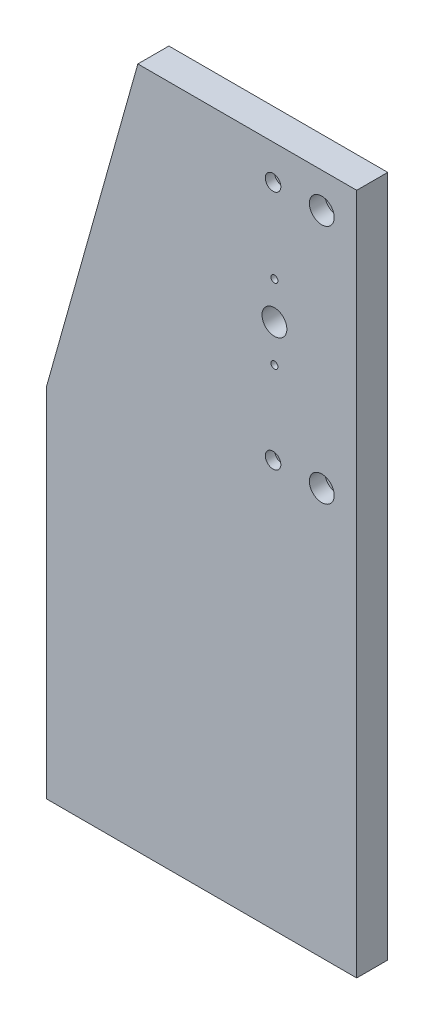
ISO-10303-21;
HEADER;
FILE_DESCRIPTION(('STEP AP214'),'2;1');
FILE_NAME('part.step','',(''),(''),'','','');
FILE_SCHEMA(('AUTOMOTIVE_DESIGN { 1 0 10303 214 1 1 1 1 }'));
ENDSEC;
DATA;
#1=APPLICATION_CONTEXT('core data for automotive mechanical design processes');
#2=APPLICATION_PROTOCOL_DEFINITION('international standard','automotive_design',2000,#1);
#3=PRODUCT_CONTEXT('',#1,'mechanical');
#4=PRODUCT('Part','Part','',(#3));
#5=PRODUCT_RELATED_PRODUCT_CATEGORY('part','',(#4));
#6=PRODUCT_DEFINITION_FORMATION('','',#4);
#7=PRODUCT_DEFINITION_CONTEXT('part definition',#1,'design');
#8=PRODUCT_DEFINITION('design','',#6,#7);
#9=PRODUCT_DEFINITION_SHAPE('','',#8);
#10=(LENGTH_UNIT() NAMED_UNIT(*) SI_UNIT(.MILLI.,.METRE.));
#11=(NAMED_UNIT(*) PLANE_ANGLE_UNIT() SI_UNIT($,.RADIAN.));
#12=(NAMED_UNIT(*) SI_UNIT($,.STERADIAN.) SOLID_ANGLE_UNIT());
#13=UNCERTAINTY_MEASURE_WITH_UNIT(LENGTH_MEASURE(1.E-05),#10,'distance_accuracy_value','');
#14=(GEOMETRIC_REPRESENTATION_CONTEXT(3) GLOBAL_UNCERTAINTY_ASSIGNED_CONTEXT((#13)) GLOBAL_UNIT_ASSIGNED_CONTEXT((#10,
#11,#12)) REPRESENTATION_CONTEXT('',''));
#15=CARTESIAN_POINT('',(0.,0.,0.));
#16=DIRECTION('',(0.,0.,1.));
#17=DIRECTION('',(1.,0.,0.));
#18=AXIS2_PLACEMENT_3D('',#15,#16,#17);
#19=CARTESIAN_POINT('',(126.12492067,261.999912039992,20.));
#20=DIRECTION('',(0.,0.,-1.));
#21=DIRECTION('',(-1.,0.,0.));
#22=AXIS2_PLACEMENT_3D('',#19,#20,#21);
#23=CYLINDRICAL_SURFACE('',#22,2.99999999999999);
#24=CARTESIAN_POINT('',(126.12492067,261.999912039992,0.));
#25=DIRECTION('',(0.,0.,1.));
#26=DIRECTION('',(1.,0.,0.));
#27=AXIS2_PLACEMENT_3D('',#24,#25,#26);
#28=CIRCLE('',#27,2.99999999999999);
#29=CARTESIAN_POINT('',(129.12492067,261.999912039992,0.));
#30=VERTEX_POINT('',#29);
#31=EDGE_CURVE('E208',#30,#30,#28,.T.);
#32=ORIENTED_EDGE('',*,*,#31,.F.);
#33=EDGE_LOOP('',(#32));
#34=FACE_BOUND('',#33,.T.);
#35=CARTESIAN_POINT('',(126.12492067,261.999912039992,14.));
#36=DIRECTION('',(0.,0.,1.));
#37=DIRECTION('',(1.,0.,0.));
#38=AXIS2_PLACEMENT_3D('',#35,#36,#37);
#39=CIRCLE('',#38,2.99999999999999);
#40=CARTESIAN_POINT('',(129.12492067,261.999912039992,14.));
#41=VERTEX_POINT('',#40);
#42=EDGE_CURVE('E33',#41,#41,#39,.T.);
#43=ORIENTED_EDGE('',*,*,#42,.T.);
#44=EDGE_LOOP('',(#43));
#45=FACE_BOUND('',#44,.T.);
#46=ADVANCED_FACE('F29',(#34,#45),#23,.F.);
#47=CARTESIAN_POINT('',(126.12492067,416.999970679992,20.));
#48=DIRECTION('',(0.,0.,-1.));
#49=DIRECTION('',(-1.,0.,0.));
#50=AXIS2_PLACEMENT_3D('',#47,#48,#49);
#51=CYLINDRICAL_SURFACE('',#50,2.99999999999999);
#52=CARTESIAN_POINT('',(126.12492067,416.999970679992,0.));
#53=DIRECTION('',(0.,0.,1.));
#54=DIRECTION('',(1.,0.,0.));
#55=AXIS2_PLACEMENT_3D('',#52,#53,#54);
#56=CIRCLE('',#55,2.99999999999999);
#57=CARTESIAN_POINT('',(129.12492067,416.999970679992,0.));
#58=VERTEX_POINT('',#57);
#59=EDGE_CURVE('E123',#58,#58,#56,.T.);
#60=ORIENTED_EDGE('',*,*,#59,.F.);
#61=EDGE_LOOP('',(#60));
#62=FACE_BOUND('',#61,.T.);
#63=CARTESIAN_POINT('',(126.12492067,416.999970679992,14.));
#64=DIRECTION('',(0.,0.,1.));
#65=DIRECTION('',(1.,0.,0.));
#66=AXIS2_PLACEMENT_3D('',#63,#64,#65);
#67=CIRCLE('',#66,2.99999999999999);
#68=CARTESIAN_POINT('',(129.12492067,416.999970679992,14.));
#69=VERTEX_POINT('',#68);
#70=EDGE_CURVE('E129',#69,#69,#67,.T.);
#71=ORIENTED_EDGE('',*,*,#70,.T.);
#72=EDGE_LOOP('',(#71));
#73=FACE_BOUND('',#72,.T.);
#74=ADVANCED_FACE('F253',(#62,#73),#51,.F.);
#75=CARTESIAN_POINT('',(157.49992067,261.999912039992,20.));
#76=DIRECTION('',(0.,0.,-1.));
#77=DIRECTION('',(-1.,0.,0.));
#78=AXIS2_PLACEMENT_3D('',#75,#76,#77);
#79=CYLINDRICAL_SURFACE('',#78,4.99999999999999);
#80=CARTESIAN_POINT('',(157.49992067,261.999912039992,0.));
#81=DIRECTION('',(0.,0.,1.));
#82=DIRECTION('',(1.,0.,0.));
#83=AXIS2_PLACEMENT_3D('',#80,#81,#82);
#84=CIRCLE('',#83,4.99999999999999);
#85=CARTESIAN_POINT('',(162.49992067,261.999912039992,0.));
#86=VERTEX_POINT('',#85);
#87=EDGE_CURVE('E211',#86,#86,#84,.T.);
#88=ORIENTED_EDGE('',*,*,#87,.F.);
#89=EDGE_LOOP('',(#88));
#90=FACE_BOUND('',#89,.T.);
#91=CARTESIAN_POINT('',(157.49992067,261.999912039992,10.));
#92=DIRECTION('',(0.,0.,1.));
#93=DIRECTION('',(1.,0.,0.));
#94=AXIS2_PLACEMENT_3D('',#91,#92,#93);
#95=CIRCLE('',#94,4.99999999999999);
#96=CARTESIAN_POINT('',(162.49992067,261.999912039992,10.));
#97=VERTEX_POINT('',#96);
#98=EDGE_CURVE('E125',#97,#97,#95,.T.);
#99=ORIENTED_EDGE('',*,*,#98,.T.);
#100=EDGE_LOOP('',(#99));
#101=FACE_BOUND('',#100,.T.);
#102=ADVANCED_FACE('F260',(#90,#101),#79,.F.);
#103=CARTESIAN_POINT('',(157.49992067,416.999970679992,20.));
#104=DIRECTION('',(0.,0.,-1.));
#105=DIRECTION('',(-1.,0.,0.));
#106=AXIS2_PLACEMENT_3D('',#103,#104,#105);
#107=CYLINDRICAL_SURFACE('',#106,4.99999999999999);
#108=CARTESIAN_POINT('',(157.49992067,416.999970679992,0.));
#109=DIRECTION('',(0.,0.,1.));
#110=DIRECTION('',(1.,0.,0.));
#111=AXIS2_PLACEMENT_3D('',#108,#109,#110);
#112=CIRCLE('',#111,4.99999999999999);
#113=CARTESIAN_POINT('',(162.49992067,416.999970679992,0.));
#114=VERTEX_POINT('',#113);
#115=EDGE_CURVE('E214',#114,#114,#112,.T.);
#116=ORIENTED_EDGE('',*,*,#115,.F.);
#117=EDGE_LOOP('',(#116));
#118=FACE_BOUND('',#117,.T.);
#119=CARTESIAN_POINT('',(157.49992067,416.999970679992,10.));
#120=DIRECTION('',(0.,0.,1.));
#121=DIRECTION('',(1.,0.,0.));
#122=AXIS2_PLACEMENT_3D('',#119,#120,#121);
#123=CIRCLE('',#122,4.99999999999999);
#124=CARTESIAN_POINT('',(162.49992067,416.999970679992,10.));
#125=VERTEX_POINT('',#124);
#126=EDGE_CURVE('E120',#125,#125,#123,.T.);
#127=ORIENTED_EDGE('',*,*,#126,.T.);
#128=EDGE_LOOP('',(#127));
#129=FACE_BOUND('',#128,.T.);
#130=ADVANCED_FACE('F269',(#118,#129),#107,.F.);
#131=CARTESIAN_POINT('',(180.,0.,20.));
#132=DIRECTION('',(0.,0.,-1.));
#133=DIRECTION('',(-1.,0.,0.));
#134=AXIS2_PLACEMENT_3D('',#131,#132,#133);
#135=PLANE('',#134);
#136=CARTESIAN_POINT('',(126.12492067,261.999912039992,20.));
#137=DIRECTION('',(0.,0.,1.));
#138=DIRECTION('',(1.,0.,0.));
#139=AXIS2_PLACEMENT_3D('',#136,#137,#138);
#140=CIRCLE('',#139,4.99999999999999);
#141=CARTESIAN_POINT('',(131.12492067,261.999912039992,20.));
#142=VERTEX_POINT('',#141);
#143=EDGE_CURVE('E539',#142,#142,#140,.T.);
#144=ORIENTED_EDGE('',*,*,#143,.F.);
#145=EDGE_LOOP('',(#144));
#146=FACE_BOUND('',#145,.T.);
#147=CARTESIAN_POINT('',(126.12492067,416.999970679992,20.));
#148=DIRECTION('',(0.,0.,1.));
#149=DIRECTION('',(1.,0.,0.));
#150=AXIS2_PLACEMENT_3D('',#147,#148,#149);
#151=CIRCLE('',#150,4.99999999999999);
#152=CARTESIAN_POINT('',(131.12492067,416.999970679992,20.));
#153=VERTEX_POINT('',#152);
#154=EDGE_CURVE('E139',#153,#153,#151,.T.);
#155=ORIENTED_EDGE('',*,*,#154,.F.);
#156=EDGE_LOOP('',(#155));
#157=FACE_BOUND('',#156,.T.);
#158=CARTESIAN_POINT('',(157.49992067,261.999912039992,20.));
#159=DIRECTION('',(0.,0.,1.));
#160=DIRECTION('',(1.,0.,0.));
#161=AXIS2_PLACEMENT_3D('',#158,#159,#160);
#162=CIRCLE('',#161,8.00000000000001);
#163=CARTESIAN_POINT('',(165.49992067,261.999912039992,20.));
#164=VERTEX_POINT('',#163);
#165=EDGE_CURVE('E197',#164,#164,#162,.T.);
#166=ORIENTED_EDGE('',*,*,#165,.F.);
#167=EDGE_LOOP('',(#166));
#168=FACE_BOUND('',#167,.T.);
#169=CARTESIAN_POINT('',(157.49992067,416.999970679992,20.));
#170=DIRECTION('',(0.,0.,1.));
#171=DIRECTION('',(1.,0.,0.));
#172=AXIS2_PLACEMENT_3D('',#169,#170,#171);
#173=CIRCLE('',#172,8.00000000000001);
#174=CARTESIAN_POINT('',(165.49992067,416.999970679992,20.));
#175=VERTEX_POINT('',#174);
#176=EDGE_CURVE('E127',#175,#175,#173,.T.);
#177=ORIENTED_EDGE('',*,*,#176,.F.);
#178=EDGE_LOOP('',(#177));
#179=FACE_BOUND('',#178,.T.);
#180=CARTESIAN_POINT('',(126.999907999992,315.499941359992,20.));
#181=DIRECTION('',(0.,0.,1.));
#182=DIRECTION('',(1.,0.,0.));
#183=AXIS2_PLACEMENT_3D('',#180,#181,#182);
#184=CIRCLE('',#183,2.25000000000001);
#185=CARTESIAN_POINT('',(129.249907999992,315.499941359992,20.));
#186=VERTEX_POINT('',#185);
#187=EDGE_CURVE('E226',#186,#186,#184,.T.);
#188=ORIENTED_EDGE('',*,*,#187,.F.);
#189=EDGE_LOOP('',(#188));
#190=FACE_BOUND('',#189,.T.);
#191=DIRECTION('',(0.,1.,0.));
#192=VECTOR('',#191,1.);
#193=CARTESIAN_POINT('',(180.,30.,20.));
#194=LINE('',#193,#192);
#195=CARTESIAN_POINT('',(180.,0.,20.));
#196=VERTEX_POINT('',#195);
#197=CARTESIAN_POINT('',(180.,439.500014530256,20.));
#198=VERTEX_POINT('',#197);
#199=EDGE_CURVE('E46',#196,#198,#194,.T.);
#200=ORIENTED_EDGE('',*,*,#199,.T.);
#201=DIRECTION('',(-0.999999999999865,-5.18937700120816E-07,0.));
#202=VECTOR('',#201,1.);
#203=CARTESIAN_POINT('',(180.,439.500014530256,20.));
#204=LINE('',#203,#202);
#205=CARTESIAN_POINT('',(38.9999079999848,439.499941359992,20.));
#206=VERTEX_POINT('',#205);
#207=EDGE_CURVE('E98',#198,#206,#204,.T.);
#208=ORIENTED_EDGE('',*,*,#207,.T.);
#209=DIRECTION('',(-0.270479723466261,-0.962725671826411,0.));
#210=VECTOR('',#209,1.);
#211=CARTESIAN_POINT('',(-20.,229.5,20.));
#212=LINE('',#211,#210);
#213=CARTESIAN_POINT('',(-20.,229.5,20.));
#214=VERTEX_POINT('',#213);
#215=EDGE_CURVE('E100',#206,#214,#212,.T.);
#216=ORIENTED_EDGE('',*,*,#215,.T.);
#217=DIRECTION('',(0.,-1.,0.));
#218=VECTOR('',#217,1.);
#219=CARTESIAN_POINT('',(-20.,229.5,20.));
#220=LINE('',#219,#218);
#221=CARTESIAN_POINT('',(-20.,0.,20.));
#222=VERTEX_POINT('',#221);
#223=EDGE_CURVE('E53',#214,#222,#220,.T.);
#224=ORIENTED_EDGE('',*,*,#223,.T.);
#225=DIRECTION('',(1.,0.,0.));
#226=VECTOR('',#225,1.);
#227=CARTESIAN_POINT('',(-20.,0.,20.));
#228=LINE('',#227,#226);
#229=EDGE_CURVE('E105',#222,#196,#228,.T.);
#230=ORIENTED_EDGE('',*,*,#229,.T.);
#231=EDGE_LOOP('',(#200,#208,#216,#224,#230));
#232=FACE_BOUND('',#231,.T.);
#233=CARTESIAN_POINT('',(126.999907999993,339.499941359992,20.));
#234=DIRECTION('',(0.,0.,1.));
#235=DIRECTION('',(1.,0.,0.));
#236=AXIS2_PLACEMENT_3D('',#233,#234,#235);
#237=CIRCLE('',#236,7.99999999999996);
#238=CARTESIAN_POINT('',(134.999907999992,339.499941359992,20.));
#239=VERTEX_POINT('',#238);
#240=EDGE_CURVE('E96',#239,#239,#237,.T.);
#241=ORIENTED_EDGE('',*,*,#240,.F.);
#242=EDGE_LOOP('',(#241));
#243=FACE_BOUND('',#242,.T.);
#244=CARTESIAN_POINT('',(126.999907999992,363.499941359992,20.));
#245=DIRECTION('',(0.,0.,1.));
#246=DIRECTION('',(1.,0.,0.));
#247=AXIS2_PLACEMENT_3D('',#244,#245,#246);
#248=CIRCLE('',#247,2.25000000000001);
#249=CARTESIAN_POINT('',(129.249907999992,363.499941359992,20.));
#250=VERTEX_POINT('',#249);
#251=EDGE_CURVE('E220',#250,#250,#248,.T.);
#252=ORIENTED_EDGE('',*,*,#251,.F.);
#253=EDGE_LOOP('',(#252));
#254=FACE_BOUND('',#253,.T.);
#255=ADVANCED_FACE('F102',(#146,#157,#168,#179,#190,#232,#243,#254),#135,.F.);
#256=CARTESIAN_POINT('',(180.,0.,0.));
#257=DIRECTION('',(0.,0.,-1.));
#258=DIRECTION('',(-1.,0.,0.));
#259=AXIS2_PLACEMENT_3D('',#256,#257,#258);
#260=PLANE('',#259);
#261=ORIENTED_EDGE('',*,*,#31,.T.);
#262=EDGE_LOOP('',(#261));
#263=FACE_BOUND('',#262,.T.);
#264=ORIENTED_EDGE('',*,*,#115,.T.);
#265=EDGE_LOOP('',(#264));
#266=FACE_BOUND('',#265,.T.);
#267=CARTESIAN_POINT('',(126.999907999992,315.499941359992,0.));
#268=DIRECTION('',(0.,0.,1.));
#269=DIRECTION('',(1.,0.,0.));
#270=AXIS2_PLACEMENT_3D('',#267,#268,#269);
#271=CIRCLE('',#270,2.25000000000001);
#272=CARTESIAN_POINT('',(129.249907999992,315.499941359992,0.));
#273=VERTEX_POINT('',#272);
#274=EDGE_CURVE('E223',#273,#273,#271,.T.);
#275=ORIENTED_EDGE('',*,*,#274,.T.);
#276=EDGE_LOOP('',(#275));
#277=FACE_BOUND('',#276,.T.);
#278=DIRECTION('',(-0.999999999999865,-5.18937700120816E-07,0.));
#279=VECTOR('',#278,1.);
#280=CARTESIAN_POINT('',(180.,439.500014530256,0.));
#281=LINE('',#280,#279);
#282=CARTESIAN_POINT('',(180.,439.500014530256,0.));
#283=VERTEX_POINT('',#282);
#284=CARTESIAN_POINT('',(38.9999079999848,439.499941359992,0.));
#285=VERTEX_POINT('',#284);
#286=EDGE_CURVE('E88',#283,#285,#281,.T.);
#287=ORIENTED_EDGE('',*,*,#286,.F.);
#288=DIRECTION('',(0.,1.,0.));
#289=VECTOR('',#288,1.);
#290=CARTESIAN_POINT('',(180.,0.,0.));
#291=LINE('',#290,#289);
#292=CARTESIAN_POINT('',(180.,0.,0.));
#293=VERTEX_POINT('',#292);
#294=EDGE_CURVE('E78',#293,#283,#291,.T.);
#295=ORIENTED_EDGE('',*,*,#294,.F.);
#296=DIRECTION('',(1.,0.,0.));
#297=VECTOR('',#296,1.);
#298=CARTESIAN_POINT('',(-20.,0.,0.));
#299=LINE('',#298,#297);
#300=CARTESIAN_POINT('',(-20.,0.,0.));
#301=VERTEX_POINT('',#300);
#302=EDGE_CURVE('E85',#301,#293,#299,.T.);
#303=ORIENTED_EDGE('',*,*,#302,.F.);
#304=DIRECTION('',(0.,-1.,0.));
#305=VECTOR('',#304,1.);
#306=CARTESIAN_POINT('',(-20.,30.,0.));
#307=LINE('',#306,#305);
#308=CARTESIAN_POINT('',(-20.,229.5,0.));
#309=VERTEX_POINT('',#308);
#310=EDGE_CURVE('E235',#309,#301,#307,.T.);
#311=ORIENTED_EDGE('',*,*,#310,.F.);
#312=DIRECTION('',(-0.270479723466261,-0.962725671826411,0.));
#313=VECTOR('',#312,1.);
#314=CARTESIAN_POINT('',(-20.,229.5,0.));
#315=LINE('',#314,#313);
#316=EDGE_CURVE('E92',#285,#309,#315,.T.);
#317=ORIENTED_EDGE('',*,*,#316,.F.);
#318=EDGE_LOOP('',(#287,#295,#303,#311,#317));
#319=FACE_BOUND('',#318,.T.);
#320=CARTESIAN_POINT('',(126.999907999993,339.499941359992,0.));
#321=DIRECTION('',(0.,0.,1.));
#322=DIRECTION('',(1.,0.,0.));
#323=AXIS2_PLACEMENT_3D('',#320,#321,#322);
#324=CIRCLE('',#323,7.99999999999996);
#325=CARTESIAN_POINT('',(134.999907999992,339.499941359992,0.));
#326=VERTEX_POINT('',#325);
#327=EDGE_CURVE('E229',#326,#326,#324,.T.);
#328=ORIENTED_EDGE('',*,*,#327,.T.);
#329=EDGE_LOOP('',(#328));
#330=FACE_BOUND('',#329,.T.);
#331=CARTESIAN_POINT('',(126.999907999992,363.499941359992,0.));
#332=DIRECTION('',(0.,0.,1.));
#333=DIRECTION('',(1.,0.,0.));
#334=AXIS2_PLACEMENT_3D('',#331,#332,#333);
#335=CIRCLE('',#334,2.25000000000001);
#336=CARTESIAN_POINT('',(129.249907999992,363.499941359992,0.));
#337=VERTEX_POINT('',#336);
#338=EDGE_CURVE('E217',#337,#337,#335,.T.);
#339=ORIENTED_EDGE('',*,*,#338,.T.);
#340=EDGE_LOOP('',(#339));
#341=FACE_BOUND('',#340,.T.);
#342=ORIENTED_EDGE('',*,*,#87,.T.);
#343=EDGE_LOOP('',(#342));
#344=FACE_BOUND('',#343,.T.);
#345=ORIENTED_EDGE('',*,*,#59,.T.);
#346=EDGE_LOOP('',(#345));
#347=FACE_BOUND('',#346,.T.);
#348=ADVANCED_FACE('F89',(#263,#266,#277,#319,#330,#341,#344,#347),#260,.T.);
#349=CARTESIAN_POINT('',(180.,439.500014530256,20.));
#350=DIRECTION('',(5.18937700120816E-07,-0.999999999999865,0.));
#351=DIRECTION('',(0.999999999999865,5.18937700120816E-07,0.));
#352=AXIS2_PLACEMENT_3D('',#349,#350,#351);
#353=PLANE('',#352);
#354=ORIENTED_EDGE('',*,*,#286,.T.);
#355=DIRECTION('',(0.,0.,-1.));
#356=VECTOR('',#355,1.);
#357=CARTESIAN_POINT('',(38.9999079999848,439.499941359992,20.));
#358=LINE('',#357,#356);
#359=EDGE_CURVE('E38',#206,#285,#358,.T.);
#360=ORIENTED_EDGE('',*,*,#359,.F.);
#361=ORIENTED_EDGE('',*,*,#207,.F.);
#362=DIRECTION('',(0.,0.,-1.));
#363=VECTOR('',#362,1.);
#364=CARTESIAN_POINT('',(180.,439.500014530256,20.));
#365=LINE('',#364,#363);
#366=EDGE_CURVE('E11',#198,#283,#365,.T.);
#367=ORIENTED_EDGE('',*,*,#366,.T.);
#368=EDGE_LOOP('',(#354,#360,#361,#367));
#369=FACE_BOUND('',#368,.T.);
#370=ADVANCED_FACE('F31',(#369),#353,.F.);
#371=CARTESIAN_POINT('',(-20.,229.5,20.));
#372=DIRECTION('',(0.962725671826411,-0.270479723466261,0.));
#373=DIRECTION('',(0.270479723466261,0.962725671826411,0.));
#374=AXIS2_PLACEMENT_3D('',#371,#372,#373);
#375=PLANE('',#374);
#376=ORIENTED_EDGE('',*,*,#316,.T.);
#377=DIRECTION('',(0.,0.,-1.));
#378=VECTOR('',#377,1.);
#379=CARTESIAN_POINT('',(-20.,229.5,20.));
#380=LINE('',#379,#378);
#381=EDGE_CURVE('E116',#214,#309,#380,.T.);
#382=ORIENTED_EDGE('',*,*,#381,.F.);
#383=ORIENTED_EDGE('',*,*,#215,.F.);
#384=ORIENTED_EDGE('',*,*,#359,.T.);
#385=EDGE_LOOP('',(#376,#382,#383,#384));
#386=FACE_BOUND('',#385,.T.);
#387=ADVANCED_FACE('F241',(#386),#375,.F.);
#388=CARTESIAN_POINT('',(-20.,30.,20.));
#389=DIRECTION('',(1.,0.,0.));
#390=DIRECTION('',(0.,1.,0.));
#391=AXIS2_PLACEMENT_3D('',#388,#389,#390);
#392=PLANE('',#391);
#393=ORIENTED_EDGE('',*,*,#310,.T.);
#394=DIRECTION('',(0.,0.,-1.));
#395=VECTOR('',#394,1.);
#396=CARTESIAN_POINT('',(-20.,0.,20.));
#397=LINE('',#396,#395);
#398=EDGE_CURVE('E113',#222,#301,#397,.T.);
#399=ORIENTED_EDGE('',*,*,#398,.F.);
#400=ORIENTED_EDGE('',*,*,#223,.F.);
#401=ORIENTED_EDGE('',*,*,#381,.T.);
#402=EDGE_LOOP('',(#393,#399,#400,#401));
#403=FACE_BOUND('',#402,.T.);
#404=ADVANCED_FACE('F242',(#403),#392,.F.);
#405=CARTESIAN_POINT('',(-20.,0.,20.));
#406=DIRECTION('',(0.,1.,0.));
#407=DIRECTION('',(0.,0.,1.));
#408=AXIS2_PLACEMENT_3D('',#405,#406,#407);
#409=PLANE('',#408);
#410=CARTESIAN_POINT('',(1.49186218934005E-13,0.,10.));
#411=DIRECTION('',(0.,-1.,0.));
#412=DIRECTION('',(0.,0.,-1.));
#413=AXIS2_PLACEMENT_3D('',#410,#411,#412);
#414=CIRCLE('',#413,3.25);
#415=CARTESIAN_POINT('',(1.49186218934005E-13,0.,6.75000000000001));
#416=VERTEX_POINT('',#415);
#417=EDGE_CURVE('E131',#416,#416,#414,.T.);
#418=ORIENTED_EDGE('',*,*,#417,.F.);
#419=EDGE_LOOP('',(#418));
#420=FACE_BOUND('',#419,.T.);
#421=CARTESIAN_POINT('',(160.,0.,10.));
#422=DIRECTION('',(0.,-1.,0.));
#423=DIRECTION('',(0.,0.,-1.));
#424=AXIS2_PLACEMENT_3D('',#421,#422,#423);
#425=CIRCLE('',#424,3.25000000000001);
#426=CARTESIAN_POINT('',(160.,0.,6.75));
#427=VERTEX_POINT('',#426);
#428=EDGE_CURVE('E149',#427,#427,#425,.T.);
#429=ORIENTED_EDGE('',*,*,#428,.F.);
#430=EDGE_LOOP('',(#429));
#431=FACE_BOUND('',#430,.T.);
#432=CARTESIAN_POINT('',(140.,0.,10.));
#433=DIRECTION('',(0.,-1.,0.));
#434=DIRECTION('',(0.,0.,-1.));
#435=AXIS2_PLACEMENT_3D('',#432,#433,#434);
#436=CIRCLE('',#435,3.25000000000001);
#437=CARTESIAN_POINT('',(140.,0.,6.75));
#438=VERTEX_POINT('',#437);
#439=EDGE_CURVE('E155',#438,#438,#436,.T.);
#440=ORIENTED_EDGE('',*,*,#439,.F.);
#441=EDGE_LOOP('',(#440));
#442=FACE_BOUND('',#441,.T.);
#443=CARTESIAN_POINT('',(120.,0.,10.));
#444=DIRECTION('',(0.,-1.,0.));
#445=DIRECTION('',(0.,0.,-1.));
#446=AXIS2_PLACEMENT_3D('',#443,#444,#445);
#447=CIRCLE('',#446,3.25000000000001);
#448=CARTESIAN_POINT('',(120.,0.,6.75));
#449=VERTEX_POINT('',#448);
#450=EDGE_CURVE('E161',#449,#449,#447,.T.);
#451=ORIENTED_EDGE('',*,*,#450,.F.);
#452=EDGE_LOOP('',(#451));
#453=FACE_BOUND('',#452,.T.);
#454=CARTESIAN_POINT('',(100.,0.,10.));
#455=DIRECTION('',(0.,-1.,0.));
#456=DIRECTION('',(0.,0.,-1.));
#457=AXIS2_PLACEMENT_3D('',#454,#455,#456);
#458=CIRCLE('',#457,3.25000000000001);
#459=CARTESIAN_POINT('',(100.,0.,6.75));
#460=VERTEX_POINT('',#459);
#461=EDGE_CURVE('E167',#460,#460,#458,.T.);
#462=ORIENTED_EDGE('',*,*,#461,.F.);
#463=EDGE_LOOP('',(#462));
#464=FACE_BOUND('',#463,.T.);
#465=CARTESIAN_POINT('',(80.0000000000002,0.,10.));
#466=DIRECTION('',(0.,-1.,0.));
#467=DIRECTION('',(0.,0.,-1.));
#468=AXIS2_PLACEMENT_3D('',#465,#466,#467);
#469=CIRCLE('',#468,3.25000000000001);
#470=CARTESIAN_POINT('',(80.0000000000002,0.,6.75));
#471=VERTEX_POINT('',#470);
#472=EDGE_CURVE('E173',#471,#471,#469,.T.);
#473=ORIENTED_EDGE('',*,*,#472,.F.);
#474=EDGE_LOOP('',(#473));
#475=FACE_BOUND('',#474,.T.);
#476=CARTESIAN_POINT('',(60.0000000000001,0.,10.));
#477=DIRECTION('',(0.,-1.,0.));
#478=DIRECTION('',(0.,0.,-1.));
#479=AXIS2_PLACEMENT_3D('',#476,#477,#478);
#480=CIRCLE('',#479,3.25000000000001);
#481=CARTESIAN_POINT('',(60.0000000000001,0.,6.75));
#482=VERTEX_POINT('',#481);
#483=EDGE_CURVE('E179',#482,#482,#480,.T.);
#484=ORIENTED_EDGE('',*,*,#483,.F.);
#485=EDGE_LOOP('',(#484));
#486=FACE_BOUND('',#485,.T.);
#487=CARTESIAN_POINT('',(40.0000000000001,0.,10.));
#488=DIRECTION('',(0.,-1.,0.));
#489=DIRECTION('',(0.,0.,-1.));
#490=AXIS2_PLACEMENT_3D('',#487,#488,#489);
#491=CIRCLE('',#490,3.25);
#492=CARTESIAN_POINT('',(40.0000000000001,0.,6.75000000000001));
#493=VERTEX_POINT('',#492);
#494=EDGE_CURVE('E185',#493,#493,#491,.T.);
#495=ORIENTED_EDGE('',*,*,#494,.F.);
#496=EDGE_LOOP('',(#495));
#497=FACE_BOUND('',#496,.T.);
#498=CARTESIAN_POINT('',(20.0000000000001,0.,10.));
#499=DIRECTION('',(0.,-1.,0.));
#500=DIRECTION('',(0.,0.,-1.));
#501=AXIS2_PLACEMENT_3D('',#498,#499,#500);
#502=CIRCLE('',#501,3.25);
#503=CARTESIAN_POINT('',(20.0000000000001,0.,6.75000000000001));
#504=VERTEX_POINT('',#503);
#505=EDGE_CURVE('E191',#504,#504,#502,.T.);
#506=ORIENTED_EDGE('',*,*,#505,.F.);
#507=EDGE_LOOP('',(#506));
#508=FACE_BOUND('',#507,.T.);
#509=ORIENTED_EDGE('',*,*,#302,.T.);
#510=DIRECTION('',(0.,0.,-1.));
#511=VECTOR('',#510,1.);
#512=CARTESIAN_POINT('',(180.,0.,20.));
#513=LINE('',#512,#511);
#514=EDGE_CURVE('E82',#196,#293,#513,.T.);
#515=ORIENTED_EDGE('',*,*,#514,.F.);
#516=ORIENTED_EDGE('',*,*,#229,.F.);
#517=ORIENTED_EDGE('',*,*,#398,.T.);
#518=EDGE_LOOP('',(#509,#515,#516,#517));
#519=FACE_BOUND('',#518,.T.);
#520=ADVANCED_FACE('F237',(#420,#431,#442,#453,#464,#475,#486,#497,#508,#519),#409,.F.);
#521=CARTESIAN_POINT('',(180.,0.,20.));
#522=DIRECTION('',(-1.,0.,0.));
#523=DIRECTION('',(0.,0.,1.));
#524=AXIS2_PLACEMENT_3D('',#521,#522,#523);
#525=PLANE('',#524);
#526=ORIENTED_EDGE('',*,*,#294,.T.);
#527=ORIENTED_EDGE('',*,*,#366,.F.);
#528=ORIENTED_EDGE('',*,*,#199,.F.);
#529=ORIENTED_EDGE('',*,*,#514,.T.);
#530=EDGE_LOOP('',(#526,#527,#528,#529));
#531=FACE_BOUND('',#530,.T.);
#532=ADVANCED_FACE('F80',(#531),#525,.F.);
#533=CARTESIAN_POINT('',(126.999907999993,339.499941359992,20.));
#534=DIRECTION('',(0.,0.,-1.));
#535=DIRECTION('',(-1.,0.,0.));
#536=AXIS2_PLACEMENT_3D('',#533,#534,#535);
#537=CYLINDRICAL_SURFACE('',#536,7.99999999999996);
#538=ORIENTED_EDGE('',*,*,#240,.T.);
#539=EDGE_LOOP('',(#538));
#540=FACE_BOUND('',#539,.T.);
#541=ORIENTED_EDGE('',*,*,#327,.F.);
#542=EDGE_LOOP('',(#541));
#543=FACE_BOUND('',#542,.T.);
#544=ADVANCED_FACE('F282',(#540,#543),#537,.F.);
#545=CARTESIAN_POINT('',(126.999907999992,315.499941359992,20.));
#546=DIRECTION('',(0.,0.,-1.));
#547=DIRECTION('',(-1.,0.,0.));
#548=AXIS2_PLACEMENT_3D('',#545,#546,#547);
#549=CYLINDRICAL_SURFACE('',#548,2.25000000000001);
#550=ORIENTED_EDGE('',*,*,#187,.T.);
#551=EDGE_LOOP('',(#550));
#552=FACE_BOUND('',#551,.T.);
#553=ORIENTED_EDGE('',*,*,#274,.F.);
#554=EDGE_LOOP('',(#553));
#555=FACE_BOUND('',#554,.T.);
#556=ADVANCED_FACE('F278',(#552,#555),#549,.F.);
#557=CARTESIAN_POINT('',(126.999907999992,363.499941359992,20.));
#558=DIRECTION('',(0.,0.,-1.));
#559=DIRECTION('',(-1.,0.,0.));
#560=AXIS2_PLACEMENT_3D('',#557,#558,#559);
#561=CYLINDRICAL_SURFACE('',#560,2.25000000000001);
#562=ORIENTED_EDGE('',*,*,#251,.T.);
#563=EDGE_LOOP('',(#562));
#564=FACE_BOUND('',#563,.T.);
#565=ORIENTED_EDGE('',*,*,#338,.F.);
#566=EDGE_LOOP('',(#565));
#567=FACE_BOUND('',#566,.T.);
#568=ADVANCED_FACE('F274',(#564,#567),#561,.F.);
#569=CARTESIAN_POINT('',(157.49992067,416.999970679992,10.));
#570=DIRECTION('',(0.,0.,1.));
#571=DIRECTION('',(1.,0.,0.));
#572=AXIS2_PLACEMENT_3D('',#569,#570,#571);
#573=CYLINDRICAL_SURFACE('',#572,8.00000000000001);
#574=CARTESIAN_POINT('',(157.49992067,416.999970679992,10.));
#575=DIRECTION('',(0.,0.,1.));
#576=DIRECTION('',(1.,0.,0.));
#577=AXIS2_PLACEMENT_3D('',#574,#575,#576);
#578=CIRCLE('',#577,8.00000000000001);
#579=CARTESIAN_POINT('',(165.49992067,416.999970679992,10.));
#580=VERTEX_POINT('',#579);
#581=EDGE_CURVE('E124',#580,#580,#578,.T.);
#582=ORIENTED_EDGE('',*,*,#581,.F.);
#583=EDGE_LOOP('',(#582));
#584=FACE_BOUND('',#583,.T.);
#585=ORIENTED_EDGE('',*,*,#176,.T.);
#586=EDGE_LOOP('',(#585));
#587=FACE_BOUND('',#586,.T.);
#588=ADVANCED_FACE('F277',(#584,#587),#573,.F.);
#589=CARTESIAN_POINT('',(157.49992067,416.999970679992,10.));
#590=DIRECTION('',(0.,0.,1.));
#591=DIRECTION('',(1.,0.,0.));
#592=AXIS2_PLACEMENT_3D('',#589,#590,#591);
#593=PLANE('',#592);
#594=ORIENTED_EDGE('',*,*,#126,.F.);
#595=EDGE_LOOP('',(#594));
#596=FACE_BOUND('',#595,.T.);
#597=ORIENTED_EDGE('',*,*,#581,.T.);
#598=EDGE_LOOP('',(#597));
#599=FACE_BOUND('',#598,.T.);
#600=ADVANCED_FACE('F322',(#596,#599),#593,.T.);
#601=CARTESIAN_POINT('',(157.49992067,261.999912039992,10.));
#602=DIRECTION('',(0.,0.,1.));
#603=DIRECTION('',(1.,0.,0.));
#604=AXIS2_PLACEMENT_3D('',#601,#602,#603);
#605=CYLINDRICAL_SURFACE('',#604,8.00000000000001);
#606=CARTESIAN_POINT('',(157.49992067,261.999912039992,10.));
#607=DIRECTION('',(0.,0.,1.));
#608=DIRECTION('',(1.,0.,0.));
#609=AXIS2_PLACEMENT_3D('',#606,#607,#608);
#610=CIRCLE('',#609,8.00000000000001);
#611=CARTESIAN_POINT('',(165.49992067,261.999912039992,10.));
#612=VERTEX_POINT('',#611);
#613=EDGE_CURVE('E128',#612,#612,#610,.T.);
#614=ORIENTED_EDGE('',*,*,#613,.F.);
#615=EDGE_LOOP('',(#614));
#616=FACE_BOUND('',#615,.T.);
#617=ORIENTED_EDGE('',*,*,#165,.T.);
#618=EDGE_LOOP('',(#617));
#619=FACE_BOUND('',#618,.T.);
#620=ADVANCED_FACE('F329',(#616,#619),#605,.F.);
#621=CARTESIAN_POINT('',(157.49992067,261.999912039992,10.));
#622=DIRECTION('',(0.,0.,1.));
#623=DIRECTION('',(1.,0.,0.));
#624=AXIS2_PLACEMENT_3D('',#621,#622,#623);
#625=PLANE('',#624);
#626=ORIENTED_EDGE('',*,*,#98,.F.);
#627=EDGE_LOOP('',(#626));
#628=FACE_BOUND('',#627,.T.);
#629=ORIENTED_EDGE('',*,*,#613,.T.);
#630=EDGE_LOOP('',(#629));
#631=FACE_BOUND('',#630,.T.);
#632=ADVANCED_FACE('F337',(#628,#631),#625,.T.);
#633=CARTESIAN_POINT('',(20.0000000000001,60.,10.));
#634=DIRECTION('',(0.,-1.,0.));
#635=DIRECTION('',(0.,0.,-1.));
#636=AXIS2_PLACEMENT_3D('',#633,#634,#635);
#637=CYLINDRICAL_SURFACE('',#636,3.25);
#638=CARTESIAN_POINT('',(20.0000000000001,60.,10.));
#639=DIRECTION('',(0.,-1.,0.));
#640=DIRECTION('',(0.,0.,-1.));
#641=AXIS2_PLACEMENT_3D('',#638,#639,#640);
#642=CIRCLE('',#641,3.25);
#643=CARTESIAN_POINT('',(20.0000000000001,60.,6.75000000000001));
#644=VERTEX_POINT('',#643);
#645=EDGE_CURVE('E194',#644,#644,#642,.T.);
#646=ORIENTED_EDGE('',*,*,#645,.F.);
#647=EDGE_LOOP('',(#646));
#648=FACE_BOUND('',#647,.T.);
#649=ORIENTED_EDGE('',*,*,#505,.T.);
#650=EDGE_LOOP('',(#649));
#651=FACE_BOUND('',#650,.T.);
#652=ADVANCED_FACE('F344',(#648,#651),#637,.F.);
#653=CARTESIAN_POINT('',(20.0000000000001,60.,10.));
#654=DIRECTION('',(0.,-1.,0.));
#655=DIRECTION('',(0.,0.,-1.));
#656=AXIS2_PLACEMENT_3D('',#653,#654,#655);
#657=PLANE('',#656);
#658=ORIENTED_EDGE('',*,*,#645,.T.);
#659=EDGE_LOOP('',(#658));
#660=FACE_BOUND('',#659,.T.);
#661=ADVANCED_FACE('F357',(#660),#657,.T.);
#662=CARTESIAN_POINT('',(40.0000000000001,60.,10.));
#663=DIRECTION('',(0.,-1.,0.));
#664=DIRECTION('',(0.,0.,-1.));
#665=AXIS2_PLACEMENT_3D('',#662,#663,#664);
#666=CYLINDRICAL_SURFACE('',#665,3.25);
#667=CARTESIAN_POINT('',(40.0000000000001,60.,10.));
#668=DIRECTION('',(0.,-1.,0.));
#669=DIRECTION('',(0.,0.,-1.));
#670=AXIS2_PLACEMENT_3D('',#667,#668,#669);
#671=CIRCLE('',#670,3.25);
#672=CARTESIAN_POINT('',(40.0000000000001,60.,6.75000000000001));
#673=VERTEX_POINT('',#672);
#674=EDGE_CURVE('E188',#673,#673,#671,.T.);
#675=ORIENTED_EDGE('',*,*,#674,.F.);
#676=EDGE_LOOP('',(#675));
#677=FACE_BOUND('',#676,.T.);
#678=ORIENTED_EDGE('',*,*,#494,.T.);
#679=EDGE_LOOP('',(#678));
#680=FACE_BOUND('',#679,.T.);
#681=ADVANCED_FACE('F365',(#677,#680),#666,.F.);
#682=CARTESIAN_POINT('',(40.0000000000001,60.,10.));
#683=DIRECTION('',(0.,-1.,0.));
#684=DIRECTION('',(0.,0.,-1.));
#685=AXIS2_PLACEMENT_3D('',#682,#683,#684);
#686=PLANE('',#685);
#687=ORIENTED_EDGE('',*,*,#674,.T.);
#688=EDGE_LOOP('',(#687));
#689=FACE_BOUND('',#688,.T.);
#690=ADVANCED_FACE('F373',(#689),#686,.T.);
#691=CARTESIAN_POINT('',(60.0000000000001,60.,10.));
#692=DIRECTION('',(0.,-1.,0.));
#693=DIRECTION('',(0.,0.,-1.));
#694=AXIS2_PLACEMENT_3D('',#691,#692,#693);
#695=CYLINDRICAL_SURFACE('',#694,3.25000000000001);
#696=CARTESIAN_POINT('',(60.0000000000001,60.,10.));
#697=DIRECTION('',(0.,-1.,0.));
#698=DIRECTION('',(0.,0.,-1.));
#699=AXIS2_PLACEMENT_3D('',#696,#697,#698);
#700=CIRCLE('',#699,3.25000000000001);
#701=CARTESIAN_POINT('',(60.0000000000001,60.,6.75));
#702=VERTEX_POINT('',#701);
#703=EDGE_CURVE('E182',#702,#702,#700,.T.);
#704=ORIENTED_EDGE('',*,*,#703,.F.);
#705=EDGE_LOOP('',(#704));
#706=FACE_BOUND('',#705,.T.);
#707=ORIENTED_EDGE('',*,*,#483,.T.);
#708=EDGE_LOOP('',(#707));
#709=FACE_BOUND('',#708,.T.);
#710=ADVANCED_FACE('F381',(#706,#709),#695,.F.);
#711=CARTESIAN_POINT('',(60.0000000000001,60.,10.));
#712=DIRECTION('',(0.,-1.,0.));
#713=DIRECTION('',(0.,0.,-1.));
#714=AXIS2_PLACEMENT_3D('',#711,#712,#713);
#715=PLANE('',#714);
#716=ORIENTED_EDGE('',*,*,#703,.T.);
#717=EDGE_LOOP('',(#716));
#718=FACE_BOUND('',#717,.T.);
#719=ADVANCED_FACE('F389',(#718),#715,.T.);
#720=CARTESIAN_POINT('',(80.0000000000002,60.,10.));
#721=DIRECTION('',(0.,-1.,0.));
#722=DIRECTION('',(0.,0.,-1.));
#723=AXIS2_PLACEMENT_3D('',#720,#721,#722);
#724=CYLINDRICAL_SURFACE('',#723,3.25000000000001);
#725=CARTESIAN_POINT('',(80.0000000000002,60.,10.));
#726=DIRECTION('',(0.,-1.,0.));
#727=DIRECTION('',(0.,0.,-1.));
#728=AXIS2_PLACEMENT_3D('',#725,#726,#727);
#729=CIRCLE('',#728,3.25000000000001);
#730=CARTESIAN_POINT('',(80.0000000000002,60.,6.75));
#731=VERTEX_POINT('',#730);
#732=EDGE_CURVE('E176',#731,#731,#729,.T.);
#733=ORIENTED_EDGE('',*,*,#732,.F.);
#734=EDGE_LOOP('',(#733));
#735=FACE_BOUND('',#734,.T.);
#736=ORIENTED_EDGE('',*,*,#472,.T.);
#737=EDGE_LOOP('',(#736));
#738=FACE_BOUND('',#737,.T.);
#739=ADVANCED_FACE('F397',(#735,#738),#724,.F.);
#740=CARTESIAN_POINT('',(80.0000000000002,60.,10.));
#741=DIRECTION('',(0.,-1.,0.));
#742=DIRECTION('',(0.,0.,-1.));
#743=AXIS2_PLACEMENT_3D('',#740,#741,#742);
#744=PLANE('',#743);
#745=ORIENTED_EDGE('',*,*,#732,.T.);
#746=EDGE_LOOP('',(#745));
#747=FACE_BOUND('',#746,.T.);
#748=ADVANCED_FACE('F405',(#747),#744,.T.);
#749=CARTESIAN_POINT('',(100.,60.,10.));
#750=DIRECTION('',(0.,-1.,0.));
#751=DIRECTION('',(0.,0.,-1.));
#752=AXIS2_PLACEMENT_3D('',#749,#750,#751);
#753=CYLINDRICAL_SURFACE('',#752,3.25000000000001);
#754=CARTESIAN_POINT('',(100.,60.,10.));
#755=DIRECTION('',(0.,-1.,0.));
#756=DIRECTION('',(0.,0.,-1.));
#757=AXIS2_PLACEMENT_3D('',#754,#755,#756);
#758=CIRCLE('',#757,3.25000000000001);
#759=CARTESIAN_POINT('',(100.,60.,6.75));
#760=VERTEX_POINT('',#759);
#761=EDGE_CURVE('E170',#760,#760,#758,.T.);
#762=ORIENTED_EDGE('',*,*,#761,.F.);
#763=EDGE_LOOP('',(#762));
#764=FACE_BOUND('',#763,.T.);
#765=ORIENTED_EDGE('',*,*,#461,.T.);
#766=EDGE_LOOP('',(#765));
#767=FACE_BOUND('',#766,.T.);
#768=ADVANCED_FACE('F413',(#764,#767),#753,.F.);
#769=CARTESIAN_POINT('',(100.,60.,10.));
#770=DIRECTION('',(0.,-1.,0.));
#771=DIRECTION('',(0.,0.,-1.));
#772=AXIS2_PLACEMENT_3D('',#769,#770,#771);
#773=PLANE('',#772);
#774=ORIENTED_EDGE('',*,*,#761,.T.);
#775=EDGE_LOOP('',(#774));
#776=FACE_BOUND('',#775,.T.);
#777=ADVANCED_FACE('F421',(#776),#773,.T.);
#778=CARTESIAN_POINT('',(120.,60.,10.));
#779=DIRECTION('',(0.,-1.,0.));
#780=DIRECTION('',(0.,0.,-1.));
#781=AXIS2_PLACEMENT_3D('',#778,#779,#780);
#782=CYLINDRICAL_SURFACE('',#781,3.25000000000001);
#783=CARTESIAN_POINT('',(120.,60.,10.));
#784=DIRECTION('',(0.,-1.,0.));
#785=DIRECTION('',(0.,0.,-1.));
#786=AXIS2_PLACEMENT_3D('',#783,#784,#785);
#787=CIRCLE('',#786,3.25000000000001);
#788=CARTESIAN_POINT('',(120.,60.,6.75));
#789=VERTEX_POINT('',#788);
#790=EDGE_CURVE('E164',#789,#789,#787,.T.);
#791=ORIENTED_EDGE('',*,*,#790,.F.);
#792=EDGE_LOOP('',(#791));
#793=FACE_BOUND('',#792,.T.);
#794=ORIENTED_EDGE('',*,*,#450,.T.);
#795=EDGE_LOOP('',(#794));
#796=FACE_BOUND('',#795,.T.);
#797=ADVANCED_FACE('F429',(#793,#796),#782,.F.);
#798=CARTESIAN_POINT('',(120.,60.,10.));
#799=DIRECTION('',(0.,-1.,0.));
#800=DIRECTION('',(0.,0.,-1.));
#801=AXIS2_PLACEMENT_3D('',#798,#799,#800);
#802=PLANE('',#801);
#803=ORIENTED_EDGE('',*,*,#790,.T.);
#804=EDGE_LOOP('',(#803));
#805=FACE_BOUND('',#804,.T.);
#806=ADVANCED_FACE('F437',(#805),#802,.T.);
#807=CARTESIAN_POINT('',(140.,60.,10.));
#808=DIRECTION('',(0.,-1.,0.));
#809=DIRECTION('',(0.,0.,-1.));
#810=AXIS2_PLACEMENT_3D('',#807,#808,#809);
#811=CYLINDRICAL_SURFACE('',#810,3.25000000000001);
#812=CARTESIAN_POINT('',(140.,60.,10.));
#813=DIRECTION('',(0.,-1.,0.));
#814=DIRECTION('',(0.,0.,-1.));
#815=AXIS2_PLACEMENT_3D('',#812,#813,#814);
#816=CIRCLE('',#815,3.25000000000001);
#817=CARTESIAN_POINT('',(140.,60.,6.75));
#818=VERTEX_POINT('',#817);
#819=EDGE_CURVE('E158',#818,#818,#816,.T.);
#820=ORIENTED_EDGE('',*,*,#819,.F.);
#821=EDGE_LOOP('',(#820));
#822=FACE_BOUND('',#821,.T.);
#823=ORIENTED_EDGE('',*,*,#439,.T.);
#824=EDGE_LOOP('',(#823));
#825=FACE_BOUND('',#824,.T.);
#826=ADVANCED_FACE('F445',(#822,#825),#811,.F.);
#827=CARTESIAN_POINT('',(140.,60.,10.));
#828=DIRECTION('',(0.,-1.,0.));
#829=DIRECTION('',(0.,0.,-1.));
#830=AXIS2_PLACEMENT_3D('',#827,#828,#829);
#831=PLANE('',#830);
#832=ORIENTED_EDGE('',*,*,#819,.T.);
#833=EDGE_LOOP('',(#832));
#834=FACE_BOUND('',#833,.T.);
#835=ADVANCED_FACE('F453',(#834),#831,.T.);
#836=CARTESIAN_POINT('',(160.,60.,10.));
#837=DIRECTION('',(0.,-1.,0.));
#838=DIRECTION('',(0.,0.,-1.));
#839=AXIS2_PLACEMENT_3D('',#836,#837,#838);
#840=CYLINDRICAL_SURFACE('',#839,3.25000000000001);
#841=CARTESIAN_POINT('',(160.,60.,10.));
#842=DIRECTION('',(0.,-1.,0.));
#843=DIRECTION('',(0.,0.,-1.));
#844=AXIS2_PLACEMENT_3D('',#841,#842,#843);
#845=CIRCLE('',#844,3.25000000000001);
#846=CARTESIAN_POINT('',(160.,60.,6.75));
#847=VERTEX_POINT('',#846);
#848=EDGE_CURVE('E152',#847,#847,#845,.T.);
#849=ORIENTED_EDGE('',*,*,#848,.F.);
#850=EDGE_LOOP('',(#849));
#851=FACE_BOUND('',#850,.T.);
#852=ORIENTED_EDGE('',*,*,#428,.T.);
#853=EDGE_LOOP('',(#852));
#854=FACE_BOUND('',#853,.T.);
#855=ADVANCED_FACE('F461',(#851,#854),#840,.F.);
#856=CARTESIAN_POINT('',(160.,60.,10.));
#857=DIRECTION('',(0.,-1.,0.));
#858=DIRECTION('',(0.,0.,-1.));
#859=AXIS2_PLACEMENT_3D('',#856,#857,#858);
#860=PLANE('',#859);
#861=ORIENTED_EDGE('',*,*,#848,.T.);
#862=EDGE_LOOP('',(#861));
#863=FACE_BOUND('',#862,.T.);
#864=ADVANCED_FACE('F469',(#863),#860,.T.);
#865=CARTESIAN_POINT('',(1.49186218934005E-13,60.,10.));
#866=DIRECTION('',(0.,-1.,0.));
#867=DIRECTION('',(0.,0.,-1.));
#868=AXIS2_PLACEMENT_3D('',#865,#866,#867);
#869=CYLINDRICAL_SURFACE('',#868,3.25);
#870=CARTESIAN_POINT('',(1.49186218934005E-13,60.,10.));
#871=DIRECTION('',(0.,-1.,0.));
#872=DIRECTION('',(0.,0.,-1.));
#873=AXIS2_PLACEMENT_3D('',#870,#871,#872);
#874=CIRCLE('',#873,3.25);
#875=CARTESIAN_POINT('',(1.49186218934005E-13,60.,6.75000000000001));
#876=VERTEX_POINT('',#875);
#877=EDGE_CURVE('E136',#876,#876,#874,.T.);
#878=ORIENTED_EDGE('',*,*,#877,.F.);
#879=EDGE_LOOP('',(#878));
#880=FACE_BOUND('',#879,.T.);
#881=ORIENTED_EDGE('',*,*,#417,.T.);
#882=EDGE_LOOP('',(#881));
#883=FACE_BOUND('',#882,.T.);
#884=ADVANCED_FACE('F477',(#880,#883),#869,.F.);
#885=CARTESIAN_POINT('',(1.49186218934005E-13,60.,10.));
#886=DIRECTION('',(0.,-1.,0.));
#887=DIRECTION('',(0.,0.,-1.));
#888=AXIS2_PLACEMENT_3D('',#885,#886,#887);
#889=PLANE('',#888);
#890=ORIENTED_EDGE('',*,*,#877,.T.);
#891=EDGE_LOOP('',(#890));
#892=FACE_BOUND('',#891,.T.);
#893=ADVANCED_FACE('F484',(#892),#889,.T.);
#894=CARTESIAN_POINT('',(126.12492067,416.999970679992,14.));
#895=DIRECTION('',(0.,0.,1.));
#896=DIRECTION('',(1.,0.,0.));
#897=AXIS2_PLACEMENT_3D('',#894,#895,#896);
#898=CYLINDRICAL_SURFACE('',#897,4.99999999999999);
#899=CARTESIAN_POINT('',(126.12492067,416.999970679992,14.));
#900=DIRECTION('',(0.,0.,1.));
#901=DIRECTION('',(1.,0.,0.));
#902=AXIS2_PLACEMENT_3D('',#899,#900,#901);
#903=CIRCLE('',#902,4.99999999999999);
#904=CARTESIAN_POINT('',(131.12492067,416.999970679992,14.));
#905=VERTEX_POINT('',#904);
#906=EDGE_CURVE('E132',#905,#905,#903,.T.);
#907=ORIENTED_EDGE('',*,*,#906,.F.);
#908=EDGE_LOOP('',(#907));
#909=FACE_BOUND('',#908,.T.);
#910=ORIENTED_EDGE('',*,*,#154,.T.);
#911=EDGE_LOOP('',(#910));
#912=FACE_BOUND('',#911,.T.);
#913=ADVANCED_FACE('F491',(#909,#912),#898,.F.);
#914=CARTESIAN_POINT('',(126.12492067,416.999970679992,14.));
#915=DIRECTION('',(0.,0.,1.));
#916=DIRECTION('',(1.,0.,0.));
#917=AXIS2_PLACEMENT_3D('',#914,#915,#916);
#918=PLANE('',#917);
#919=ORIENTED_EDGE('',*,*,#70,.F.);
#920=EDGE_LOOP('',(#919));
#921=FACE_BOUND('',#920,.T.);
#922=ORIENTED_EDGE('',*,*,#906,.T.);
#923=EDGE_LOOP('',(#922));
#924=FACE_BOUND('',#923,.T.);
#925=ADVANCED_FACE('F507',(#921,#924),#918,.T.);
#926=CARTESIAN_POINT('',(126.12492067,261.999912039992,14.));
#927=DIRECTION('',(0.,0.,1.));
#928=DIRECTION('',(1.,0.,0.));
#929=AXIS2_PLACEMENT_3D('',#926,#927,#928);
#930=CYLINDRICAL_SURFACE('',#929,4.99999999999999);
#931=CARTESIAN_POINT('',(126.12492067,261.999912039992,14.));
#932=DIRECTION('',(0.,0.,1.));
#933=DIRECTION('',(1.,0.,0.));
#934=AXIS2_PLACEMENT_3D('',#931,#932,#933);
#935=CIRCLE('',#934,4.99999999999999);
#936=CARTESIAN_POINT('',(131.12492067,261.999912039992,14.));
#937=VERTEX_POINT('',#936);
#938=EDGE_CURVE('E538',#937,#937,#935,.T.);
#939=ORIENTED_EDGE('',*,*,#938,.F.);
#940=EDGE_LOOP('',(#939));
#941=FACE_BOUND('',#940,.T.);
#942=ORIENTED_EDGE('',*,*,#143,.T.);
#943=EDGE_LOOP('',(#942));
#944=FACE_BOUND('',#943,.T.);
#945=ADVANCED_FACE('F515',(#941,#944),#930,.F.);
#946=CARTESIAN_POINT('',(126.12492067,261.999912039992,14.));
#947=DIRECTION('',(0.,0.,1.));
#948=DIRECTION('',(1.,0.,0.));
#949=AXIS2_PLACEMENT_3D('',#946,#947,#948);
#950=PLANE('',#949);
#951=ORIENTED_EDGE('',*,*,#42,.F.);
#952=EDGE_LOOP('',(#951));
#953=FACE_BOUND('',#952,.T.);
#954=ORIENTED_EDGE('',*,*,#938,.T.);
#955=EDGE_LOOP('',(#954));
#956=FACE_BOUND('',#955,.T.);
#957=ADVANCED_FACE('F523',(#953,#956),#950,.T.);
#958=CLOSED_SHELL('',(#46,#74,#102,#130,#255,#348,#370,#387,#404,#520,#532,#544,#556,#568,#588,
#600,#620,#632,#652,#661,#681,#690,#710,#719,#739,#748,#768,#777,#797,#806,#826,#835,#855,#864,
#884,#893,#913,#925,#945,#957));
#959=MANIFOLD_SOLID_BREP('B2',#958);
#960=ADVANCED_BREP_SHAPE_REPRESENTATION('',(#18,#959),#14);
#961=SHAPE_DEFINITION_REPRESENTATION(#9,#960);
ENDSEC;
END-ISO-10303-21;
